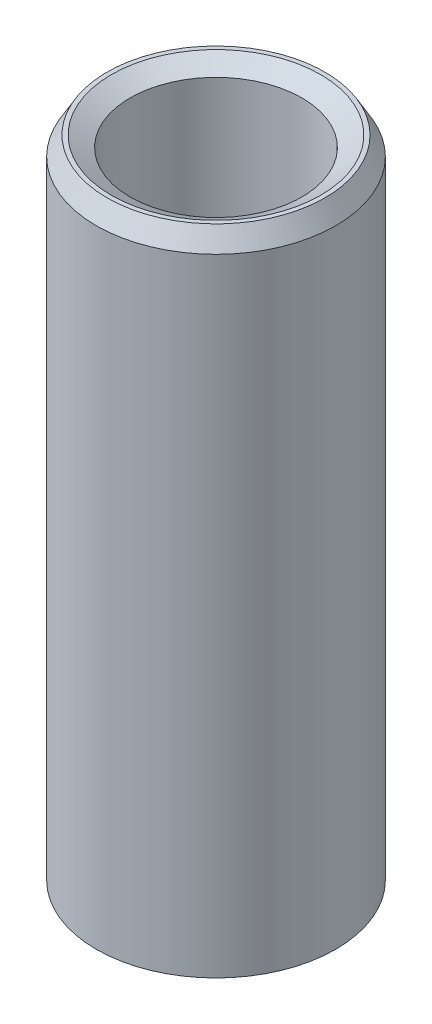
ISO-10303-21;
HEADER;
FILE_DESCRIPTION(('STEP AP214'),'2;1');
FILE_NAME('part.step','',(''),(''),'','','');
FILE_SCHEMA(('AUTOMOTIVE_DESIGN { 1 0 10303 214 1 1 1 1 }'));
ENDSEC;
DATA;
#1=APPLICATION_CONTEXT('core data for automotive mechanical design processes');
#2=APPLICATION_PROTOCOL_DEFINITION('international standard','automotive_design',2000,#1);
#3=PRODUCT_CONTEXT('',#1,'mechanical');
#4=PRODUCT('Part','Part','',(#3));
#5=PRODUCT_RELATED_PRODUCT_CATEGORY('part','',(#4));
#6=PRODUCT_DEFINITION_FORMATION('','',#4);
#7=PRODUCT_DEFINITION_CONTEXT('part definition',#1,'design');
#8=PRODUCT_DEFINITION('design','',#6,#7);
#9=PRODUCT_DEFINITION_SHAPE('','',#8);
#10=(LENGTH_UNIT() NAMED_UNIT(*) SI_UNIT(.MILLI.,.METRE.));
#11=(NAMED_UNIT(*) PLANE_ANGLE_UNIT() SI_UNIT($,.RADIAN.));
#12=(NAMED_UNIT(*) SI_UNIT($,.STERADIAN.) SOLID_ANGLE_UNIT());
#13=UNCERTAINTY_MEASURE_WITH_UNIT(LENGTH_MEASURE(1.E-05),#10,'distance_accuracy_value','');
#14=(GEOMETRIC_REPRESENTATION_CONTEXT(3) GLOBAL_UNCERTAINTY_ASSIGNED_CONTEXT((#13)) GLOBAL_UNIT_ASSIGNED_CONTEXT((#10,
#11,#12)) REPRESENTATION_CONTEXT('',''));
#15=CARTESIAN_POINT('',(0.,0.,0.));
#16=DIRECTION('',(0.,0.,1.));
#17=DIRECTION('',(1.,0.,0.));
#18=AXIS2_PLACEMENT_3D('',#15,#16,#17);
#19=CARTESIAN_POINT('',(0.,136.992967603114,0.));
#20=DIRECTION('',(0.,-1.,0.));
#21=DIRECTION('',(0.,0.,-1.));
#22=AXIS2_PLACEMENT_3D('',#19,#20,#21);
#23=CYLINDRICAL_SURFACE('',#22,25.);
#24=CARTESIAN_POINT('',(0.,2.25702037481965,0.));
#25=DIRECTION('',(0.,1.,0.));
#26=DIRECTION('',(0.,0.,1.));
#27=AXIS2_PLACEMENT_3D('',#24,#25,#26);
#28=CIRCLE('',#27,25.);
#29=CARTESIAN_POINT('',(0.,2.25702037481965,25.));
#30=VERTEX_POINT('',#29);
#31=EDGE_CURVE('E10',#30,#30,#28,.T.);
#32=ORIENTED_EDGE('',*,*,#31,.T.);
#33=EDGE_LOOP('',(#32));
#34=FACE_BOUND('',#33,.T.);
#35=CARTESIAN_POINT('',(0.,133.083693640209,0.));
#36=DIRECTION('',(0.,1.,0.));
#37=DIRECTION('',(0.,0.,1.));
#38=AXIS2_PLACEMENT_3D('',#35,#36,#37);
#39=CIRCLE('',#38,25.);
#40=CARTESIAN_POINT('',(0.,133.083693640209,25.));
#41=VERTEX_POINT('',#40);
#42=EDGE_CURVE('E50',#41,#41,#39,.F.);
#43=ORIENTED_EDGE('',*,*,#42,.T.);
#44=EDGE_LOOP('',(#43));
#45=FACE_BOUND('',#44,.T.);
#46=ADVANCED_FACE('F39',(#34,#45),#23,.T.);
#47=CARTESIAN_POINT('',(0.,136.992967603114,0.));
#48=DIRECTION('',(0.,1.,0.));
#49=DIRECTION('',(0.,0.,1.));
#50=AXIS2_PLACEMENT_3D('',#47,#48,#49);
#51=PLANE('',#50);
#52=CARTESIAN_POINT('',(0.,136.992967603114,0.));
#53=DIRECTION('',(0.,1.,0.));
#54=DIRECTION('',(0.,0.,1.));
#55=AXIS2_PLACEMENT_3D('',#52,#53,#54);
#56=CIRCLE('',#55,21.8373149216763);
#57=CARTESIAN_POINT('',(0.,136.992967603114,21.8373149216763));
#58=VERTEX_POINT('',#57);
#59=EDGE_CURVE('E58',#58,#58,#56,.F.);
#60=ORIENTED_EDGE('',*,*,#59,.T.);
#61=EDGE_LOOP('',(#60));
#62=FACE_BOUND('',#61,.T.);
#63=CARTESIAN_POINT('',(0.,136.992967603114,0.));
#64=DIRECTION('',(0.,1.,0.));
#65=DIRECTION('',(0.,0.,1.));
#66=AXIS2_PLACEMENT_3D('',#63,#64,#65);
#67=CIRCLE('',#66,22.7429796251804);
#68=CARTESIAN_POINT('',(0.,136.992967603114,22.7429796251804));
#69=VERTEX_POINT('',#68);
#70=EDGE_CURVE('E61',#69,#69,#67,.T.);
#71=ORIENTED_EDGE('',*,*,#70,.T.);
#72=EDGE_LOOP('',(#71));
#73=FACE_BOUND('',#72,.T.);
#74=ADVANCED_FACE('F88',(#62,#73),#51,.T.);
#75=CARTESIAN_POINT('',(0.,0.,0.));
#76=DIRECTION('',(0.,1.,0.));
#77=DIRECTION('',(0.,0.,1.));
#78=AXIS2_PLACEMENT_3D('',#75,#76,#77);
#79=PLANE('',#78);
#80=CARTESIAN_POINT('',(0.,0.,0.));
#81=DIRECTION('',(0.,1.,0.));
#82=DIRECTION('',(0.,0.,1.));
#83=AXIS2_PLACEMENT_3D('',#80,#81,#82);
#84=CIRCLE('',#83,20.1850613335902);
#85=CARTESIAN_POINT('',(0.,0.,20.1850613335902));
#86=VERTEX_POINT('',#85);
#87=EDGE_CURVE('E51',#86,#86,#84,.T.);
#88=ORIENTED_EDGE('',*,*,#87,.T.);
#89=EDGE_LOOP('',(#88));
#90=FACE_BOUND('',#89,.T.);
#91=CARTESIAN_POINT('',(0.,0.,0.));
#92=DIRECTION('',(0.,1.,0.));
#93=DIRECTION('',(0.,0.,1.));
#94=AXIS2_PLACEMENT_3D('',#91,#92,#93);
#95=CIRCLE('',#94,21.0907260370942);
#96=CARTESIAN_POINT('',(0.,0.,21.0907260370942));
#97=VERTEX_POINT('',#96);
#98=EDGE_CURVE('E54',#97,#97,#95,.F.);
#99=ORIENTED_EDGE('',*,*,#98,.T.);
#100=EDGE_LOOP('',(#99));
#101=FACE_BOUND('',#100,.T.);
#102=ADVANCED_FACE('F83',(#90,#101),#79,.F.);
#103=CARTESIAN_POINT('',(0.,136.992967603114,0.));
#104=DIRECTION('',(0.,-1.,0.));
#105=DIRECTION('',(0.,0.,-1.));
#106=AXIS2_PLACEMENT_3D('',#103,#104,#105);
#107=CYLINDRICAL_SURFACE('',#106,17.9280409587706);
#108=CARTESIAN_POINT('',(0.,134.735947228295,0.));
#109=DIRECTION('',(0.,1.,0.));
#110=DIRECTION('',(0.,0.,1.));
#111=AXIS2_PLACEMENT_3D('',#108,#109,#110);
#112=CIRCLE('',#111,17.9280409587706);
#113=CARTESIAN_POINT('',(0.,134.735947228295,17.9280409587706));
#114=VERTEX_POINT('',#113);
#115=EDGE_CURVE('E67',#114,#114,#112,.T.);
#116=ORIENTED_EDGE('',*,*,#115,.T.);
#117=EDGE_LOOP('',(#116));
#118=FACE_BOUND('',#117,.T.);
#119=CARTESIAN_POINT('',(0.,3.9092739629058,0.));
#120=DIRECTION('',(0.,1.,0.));
#121=DIRECTION('',(0.,0.,1.));
#122=AXIS2_PLACEMENT_3D('',#119,#120,#121);
#123=CIRCLE('',#122,17.9280409587706);
#124=CARTESIAN_POINT('',(0.,3.9092739629058,17.9280409587706));
#125=VERTEX_POINT('',#124);
#126=EDGE_CURVE('E69',#125,#125,#123,.F.);
#127=ORIENTED_EDGE('',*,*,#126,.T.);
#128=EDGE_LOOP('',(#127));
#129=FACE_BOUND('',#128,.T.);
#130=ADVANCED_FACE('F71',(#118,#129),#107,.F.);
#131=CARTESIAN_POINT('',(0.,134.735947228295,0.));
#132=DIRECTION('',(0.,1.,0.));
#133=DIRECTION('',(0.,0.,1.));
#134=AXIS2_PLACEMENT_3D('',#131,#132,#133);
#135=CONICAL_SURFACE('',#134,17.9280409587706,1.0471975511966);
#136=ORIENTED_EDGE('',*,*,#59,.F.);
#137=EDGE_LOOP('',(#136));
#138=FACE_BOUND('',#137,.T.);
#139=ORIENTED_EDGE('',*,*,#115,.F.);
#140=EDGE_LOOP('',(#139));
#141=FACE_BOUND('',#140,.T.);
#142=ADVANCED_FACE('F77',(#138,#141),#135,.F.);
#143=CARTESIAN_POINT('',(0.,0.,0.));
#144=DIRECTION('',(0.,-1.,0.));
#145=DIRECTION('',(0.,0.,-1.));
#146=AXIS2_PLACEMENT_3D('',#143,#144,#145);
#147=CONICAL_SURFACE('',#146,20.1850613335902,0.523598775598294);
#148=ORIENTED_EDGE('',*,*,#126,.F.);
#149=EDGE_LOOP('',(#148));
#150=FACE_BOUND('',#149,.T.);
#151=ORIENTED_EDGE('',*,*,#87,.F.);
#152=EDGE_LOOP('',(#151));
#153=FACE_BOUND('',#152,.T.);
#154=ADVANCED_FACE('F73',(#150,#153),#147,.F.);
#155=CARTESIAN_POINT('',(0.,2.25702037481965,0.));
#156=DIRECTION('',(0.,1.,0.));
#157=DIRECTION('',(0.,0.,1.));
#158=AXIS2_PLACEMENT_3D('',#155,#156,#157);
#159=CONICAL_SURFACE('',#158,25.,1.0471975511966);
#160=ORIENTED_EDGE('',*,*,#98,.F.);
#161=EDGE_LOOP('',(#160));
#162=FACE_BOUND('',#161,.T.);
#163=ORIENTED_EDGE('',*,*,#31,.F.);
#164=EDGE_LOOP('',(#163));
#165=FACE_BOUND('',#164,.T.);
#166=ADVANCED_FACE('F76',(#162,#165),#159,.T.);
#167=CARTESIAN_POINT('',(0.,136.992967603114,0.));
#168=DIRECTION('',(0.,-1.,0.));
#169=DIRECTION('',(0.,0.,-1.));
#170=AXIS2_PLACEMENT_3D('',#167,#168,#169);
#171=CONICAL_SURFACE('',#170,22.7429796251804,0.523598775598292);
#172=ORIENTED_EDGE('',*,*,#42,.F.);
#173=EDGE_LOOP('',(#172));
#174=FACE_BOUND('',#173,.T.);
#175=ORIENTED_EDGE('',*,*,#70,.F.);
#176=EDGE_LOOP('',(#175));
#177=FACE_BOUND('',#176,.T.);
#178=ADVANCED_FACE('F45',(#174,#177),#171,.T.);
#179=CLOSED_SHELL('',(#46,#74,#102,#130,#142,#154,#166,#178));
#180=MANIFOLD_SOLID_BREP('B2',#179);
#181=ADVANCED_BREP_SHAPE_REPRESENTATION('',(#18,#180),#14);
#182=SHAPE_DEFINITION_REPRESENTATION(#9,#181);
ENDSEC;
END-ISO-10303-21;
